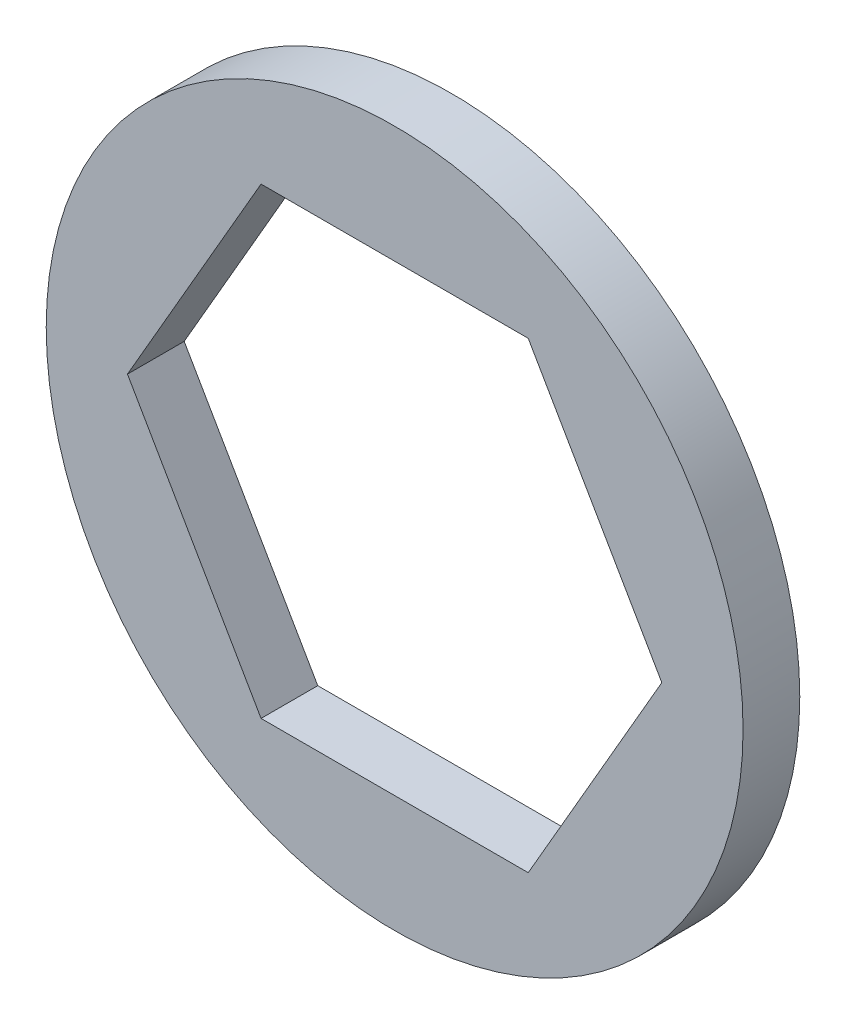
ISO-10303-21;
HEADER;
FILE_DESCRIPTION(('STEP AP214'),'2;1');
FILE_NAME('part.step','',(''),(''),'','','');
FILE_SCHEMA(('AUTOMOTIVE_DESIGN { 1 0 10303 214 1 1 1 1 }'));
ENDSEC;
DATA;
#1=APPLICATION_CONTEXT('core data for automotive mechanical design processes');
#2=APPLICATION_PROTOCOL_DEFINITION('international standard','automotive_design',2000,#1);
#3=PRODUCT_CONTEXT('',#1,'mechanical');
#4=PRODUCT('Part','Part','',(#3));
#5=PRODUCT_RELATED_PRODUCT_CATEGORY('part','',(#4));
#6=PRODUCT_DEFINITION_FORMATION('','',#4);
#7=PRODUCT_DEFINITION_CONTEXT('part definition',#1,'design');
#8=PRODUCT_DEFINITION('design','',#6,#7);
#9=PRODUCT_DEFINITION_SHAPE('','',#8);
#10=(LENGTH_UNIT() NAMED_UNIT(*) SI_UNIT(.MILLI.,.METRE.));
#11=(NAMED_UNIT(*) PLANE_ANGLE_UNIT() SI_UNIT($,.RADIAN.));
#12=(NAMED_UNIT(*) SI_UNIT($,.STERADIAN.) SOLID_ANGLE_UNIT());
#13=UNCERTAINTY_MEASURE_WITH_UNIT(LENGTH_MEASURE(1.E-05),#10,'distance_accuracy_value','');
#14=(GEOMETRIC_REPRESENTATION_CONTEXT(3) GLOBAL_UNCERTAINTY_ASSIGNED_CONTEXT((#13)) GLOBAL_UNIT_ASSIGNED_CONTEXT((#10,
#11,#12)) REPRESENTATION_CONTEXT('',''));
#15=CARTESIAN_POINT('',(0.,0.,0.));
#16=DIRECTION('',(0.,0.,1.));
#17=DIRECTION('',(1.,0.,0.));
#18=AXIS2_PLACEMENT_3D('',#15,#16,#17);
#19=CARTESIAN_POINT('',(0.,0.,1.5875));
#20=DIRECTION('',(0.,0.,1.));
#21=DIRECTION('',(1.,0.,0.));
#22=AXIS2_PLACEMENT_3D('',#19,#20,#21);
#23=PLANE('',#22);
#24=CARTESIAN_POINT('',(0.,0.,1.5875));
#25=DIRECTION('',(0.,0.,1.));
#26=DIRECTION('',(1.,0.,0.));
#27=AXIS2_PLACEMENT_3D('',#24,#25,#26);
#28=CIRCLE('',#27,9.7536);
#29=CARTESIAN_POINT('',(9.7536,0.,1.5875));
#30=VERTEX_POINT('',#29);
#31=EDGE_CURVE('E11',#30,#30,#28,.T.);
#32=ORIENTED_EDGE('',*,*,#31,.T.);
#33=EDGE_LOOP('',(#32));
#34=FACE_BOUND('',#33,.T.);
#35=DIRECTION('',(-0.5,0.866025403784438,0.));
#36=VECTOR('',#35,1.);
#37=CARTESIAN_POINT('',(7.47899538708242,0.,1.5875));
#38=LINE('',#37,#36);
#39=CARTESIAN_POINT('',(7.47899538708242,0.,1.5875));
#40=VERTEX_POINT('',#39);
#41=CARTESIAN_POINT('',(3.7394976935412,6.47700000000002,1.5875));
#42=VERTEX_POINT('',#41);
#43=EDGE_CURVE('E113',#40,#42,#38,.T.);
#44=ORIENTED_EDGE('',*,*,#43,.F.);
#45=DIRECTION('',(0.5,0.866025403784439,0.));
#46=VECTOR('',#45,1.);
#47=CARTESIAN_POINT('',(3.7394976935412,-6.47700000000001,1.5875));
#48=LINE('',#47,#46);
#49=CARTESIAN_POINT('',(3.7394976935412,-6.47700000000001,1.5875));
#50=VERTEX_POINT('',#49);
#51=EDGE_CURVE('E104',#50,#40,#48,.T.);
#52=ORIENTED_EDGE('',*,*,#51,.F.);
#53=DIRECTION('',(1.,0.,0.));
#54=VECTOR('',#53,1.);
#55=CARTESIAN_POINT('',(-3.73949769354121,-6.47700000000001,1.5875));
#56=LINE('',#55,#54);
#57=CARTESIAN_POINT('',(-3.73949769354121,-6.47700000000001,1.5875));
#58=VERTEX_POINT('',#57);
#59=EDGE_CURVE('E140',#58,#50,#56,.T.);
#60=ORIENTED_EDGE('',*,*,#59,.F.);
#61=DIRECTION('',(0.5,-0.866025403784439,0.));
#62=VECTOR('',#61,1.);
#63=CARTESIAN_POINT('',(-7.47899538708242,0.,1.5875));
#64=LINE('',#63,#62);
#65=CARTESIAN_POINT('',(-7.47899538708242,0.,1.5875));
#66=VERTEX_POINT('',#65);
#67=EDGE_CURVE('E137',#66,#58,#64,.T.);
#68=ORIENTED_EDGE('',*,*,#67,.F.);
#69=DIRECTION('',(-0.5,-0.866025403784439,0.));
#70=VECTOR('',#69,1.);
#71=CARTESIAN_POINT('',(-3.73949769354121,6.47700000000002,1.5875));
#72=LINE('',#71,#70);
#73=CARTESIAN_POINT('',(-3.73949769354121,6.47700000000002,1.5875));
#74=VERTEX_POINT('',#73);
#75=EDGE_CURVE('E132',#74,#66,#72,.T.);
#76=ORIENTED_EDGE('',*,*,#75,.F.);
#77=DIRECTION('',(-1.,0.,0.));
#78=VECTOR('',#77,1.);
#79=CARTESIAN_POINT('',(3.7394976935412,6.47700000000002,1.5875));
#80=LINE('',#79,#78);
#81=EDGE_CURVE('E126',#42,#74,#80,.T.);
#82=ORIENTED_EDGE('',*,*,#81,.F.);
#83=EDGE_LOOP('',(#44,#52,#60,#68,#76,#82));
#84=FACE_BOUND('',#83,.T.);
#85=ADVANCED_FACE('F38',(#34,#84),#23,.T.);
#86=CARTESIAN_POINT('',(0.,0.,0.));
#87=DIRECTION('',(0.,0.,1.));
#88=DIRECTION('',(1.,0.,0.));
#89=AXIS2_PLACEMENT_3D('',#86,#87,#88);
#90=PLANE('',#89);
#91=CARTESIAN_POINT('',(0.,0.,0.));
#92=DIRECTION('',(0.,0.,1.));
#93=DIRECTION('',(1.,0.,0.));
#94=AXIS2_PLACEMENT_3D('',#91,#92,#93);
#95=CIRCLE('',#94,9.7536);
#96=CARTESIAN_POINT('',(9.7536,0.,0.));
#97=VERTEX_POINT('',#96);
#98=EDGE_CURVE('E42',#97,#97,#95,.T.);
#99=ORIENTED_EDGE('',*,*,#98,.F.);
#100=EDGE_LOOP('',(#99));
#101=FACE_BOUND('',#100,.T.);
#102=DIRECTION('',(0.5,0.866025403784439,0.));
#103=VECTOR('',#102,1.);
#104=CARTESIAN_POINT('',(3.7394976935412,-6.47700000000001,0.));
#105=LINE('',#104,#103);
#106=CARTESIAN_POINT('',(3.7394976935412,-6.47700000000001,0.));
#107=VERTEX_POINT('',#106);
#108=CARTESIAN_POINT('',(7.47899538708242,0.,0.));
#109=VERTEX_POINT('',#108);
#110=EDGE_CURVE('E66',#107,#109,#105,.T.);
#111=ORIENTED_EDGE('',*,*,#110,.T.);
#112=DIRECTION('',(-0.5,0.866025403784438,0.));
#113=VECTOR('',#112,1.);
#114=CARTESIAN_POINT('',(7.47899538708242,0.,0.));
#115=LINE('',#114,#113);
#116=CARTESIAN_POINT('',(3.7394976935412,6.47700000000002,0.));
#117=VERTEX_POINT('',#116);
#118=EDGE_CURVE('E120',#109,#117,#115,.T.);
#119=ORIENTED_EDGE('',*,*,#118,.T.);
#120=DIRECTION('',(-1.,0.,0.));
#121=VECTOR('',#120,1.);
#122=CARTESIAN_POINT('',(3.7394976935412,6.47700000000002,0.));
#123=LINE('',#122,#121);
#124=CARTESIAN_POINT('',(-3.73949769354121,6.47700000000002,0.));
#125=VERTEX_POINT('',#124);
#126=EDGE_CURVE('E146',#117,#125,#123,.T.);
#127=ORIENTED_EDGE('',*,*,#126,.T.);
#128=DIRECTION('',(-0.5,-0.866025403784439,0.));
#129=VECTOR('',#128,1.);
#130=CARTESIAN_POINT('',(-3.73949769354121,6.47700000000002,0.));
#131=LINE('',#130,#129);
#132=CARTESIAN_POINT('',(-7.47899538708242,0.,0.));
#133=VERTEX_POINT('',#132);
#134=EDGE_CURVE('E150',#125,#133,#131,.T.);
#135=ORIENTED_EDGE('',*,*,#134,.T.);
#136=DIRECTION('',(0.5,-0.866025403784439,0.));
#137=VECTOR('',#136,1.);
#138=CARTESIAN_POINT('',(-7.47899538708242,0.,0.));
#139=LINE('',#138,#137);
#140=CARTESIAN_POINT('',(-3.73949769354121,-6.47700000000001,0.));
#141=VERTEX_POINT('',#140);
#142=EDGE_CURVE('E154',#133,#141,#139,.T.);
#143=ORIENTED_EDGE('',*,*,#142,.T.);
#144=DIRECTION('',(1.,0.,0.));
#145=VECTOR('',#144,1.);
#146=CARTESIAN_POINT('',(-3.73949769354121,-6.47700000000001,0.));
#147=LINE('',#146,#145);
#148=EDGE_CURVE('E114',#141,#107,#147,.T.);
#149=ORIENTED_EDGE('',*,*,#148,.T.);
#150=EDGE_LOOP('',(#111,#119,#127,#135,#143,#149));
#151=FACE_BOUND('',#150,.T.);
#152=ADVANCED_FACE('F177',(#101,#151),#90,.F.);
#153=CARTESIAN_POINT('',(0.,0.,1.5875));
#154=DIRECTION('',(0.,0.,-1.));
#155=DIRECTION('',(-1.,0.,0.));
#156=AXIS2_PLACEMENT_3D('',#153,#154,#155);
#157=CYLINDRICAL_SURFACE('',#156,9.7536);
#158=ORIENTED_EDGE('',*,*,#31,.F.);
#159=EDGE_LOOP('',(#158));
#160=FACE_BOUND('',#159,.T.);
#161=ORIENTED_EDGE('',*,*,#98,.T.);
#162=EDGE_LOOP('',(#161));
#163=FACE_BOUND('',#162,.T.);
#164=ADVANCED_FACE('F40',(#160,#163),#157,.T.);
#165=CARTESIAN_POINT('',(3.7394976935412,-6.47700000000001,1.5875));
#166=DIRECTION('',(-0.866025403784438,0.5,0.));
#167=DIRECTION('',(-0.5,-0.866025403784439,0.));
#168=AXIS2_PLACEMENT_3D('',#165,#166,#167);
#169=PLANE('',#168);
#170=ORIENTED_EDGE('',*,*,#110,.F.);
#171=DIRECTION('',(0.,0.,-1.));
#172=VECTOR('',#171,1.);
#173=CARTESIAN_POINT('',(3.7394976935412,-6.47700000000001,1.5875));
#174=LINE('',#173,#172);
#175=EDGE_CURVE('E108',#50,#107,#174,.T.);
#176=ORIENTED_EDGE('',*,*,#175,.F.);
#177=ORIENTED_EDGE('',*,*,#51,.T.);
#178=DIRECTION('',(0.,0.,-1.));
#179=VECTOR('',#178,1.);
#180=CARTESIAN_POINT('',(7.47899538708242,0.,1.5875));
#181=LINE('',#180,#179);
#182=EDGE_CURVE('E107',#40,#109,#181,.T.);
#183=ORIENTED_EDGE('',*,*,#182,.T.);
#184=EDGE_LOOP('',(#170,#176,#177,#183));
#185=FACE_BOUND('',#184,.T.);
#186=ADVANCED_FACE('F106',(#185),#169,.T.);
#187=CARTESIAN_POINT('',(7.47899538708242,0.,1.5875));
#188=DIRECTION('',(-0.866025403784438,-0.5,0.));
#189=DIRECTION('',(0.5,-0.866025403784438,0.));
#190=AXIS2_PLACEMENT_3D('',#187,#188,#189);
#191=PLANE('',#190);
#192=ORIENTED_EDGE('',*,*,#118,.F.);
#193=ORIENTED_EDGE('',*,*,#182,.F.);
#194=ORIENTED_EDGE('',*,*,#43,.T.);
#195=DIRECTION('',(0.,0.,-1.));
#196=VECTOR('',#195,1.);
#197=CARTESIAN_POINT('',(3.7394976935412,6.47700000000002,1.5875));
#198=LINE('',#197,#196);
#199=EDGE_CURVE('E122',#42,#117,#198,.T.);
#200=ORIENTED_EDGE('',*,*,#199,.T.);
#201=EDGE_LOOP('',(#192,#193,#194,#200));
#202=FACE_BOUND('',#201,.T.);
#203=ADVANCED_FACE('F117',(#202),#191,.T.);
#204=CARTESIAN_POINT('',(3.7394976935412,6.47700000000002,1.5875));
#205=DIRECTION('',(0.,-1.,0.));
#206=DIRECTION('',(0.,0.,-1.));
#207=AXIS2_PLACEMENT_3D('',#204,#205,#206);
#208=PLANE('',#207);
#209=ORIENTED_EDGE('',*,*,#126,.F.);
#210=ORIENTED_EDGE('',*,*,#199,.F.);
#211=ORIENTED_EDGE('',*,*,#81,.T.);
#212=DIRECTION('',(0.,0.,-1.));
#213=VECTOR('',#212,1.);
#214=CARTESIAN_POINT('',(-3.73949769354121,6.47700000000002,1.5875));
#215=LINE('',#214,#213);
#216=EDGE_CURVE('E168',#74,#125,#215,.T.);
#217=ORIENTED_EDGE('',*,*,#216,.T.);
#218=EDGE_LOOP('',(#209,#210,#211,#217));
#219=FACE_BOUND('',#218,.T.);
#220=ADVANCED_FACE('F173',(#219),#208,.T.);
#221=CARTESIAN_POINT('',(-3.73949769354121,6.47700000000002,1.5875));
#222=DIRECTION('',(0.866025403784439,-0.5,0.));
#223=DIRECTION('',(0.5,0.866025403784439,0.));
#224=AXIS2_PLACEMENT_3D('',#221,#222,#223);
#225=PLANE('',#224);
#226=ORIENTED_EDGE('',*,*,#134,.F.);
#227=ORIENTED_EDGE('',*,*,#216,.F.);
#228=ORIENTED_EDGE('',*,*,#75,.T.);
#229=DIRECTION('',(0.,0.,-1.));
#230=VECTOR('',#229,1.);
#231=CARTESIAN_POINT('',(-7.47899538708242,0.,1.5875));
#232=LINE('',#231,#230);
#233=EDGE_CURVE('E165',#66,#133,#232,.T.);
#234=ORIENTED_EDGE('',*,*,#233,.T.);
#235=EDGE_LOOP('',(#226,#227,#228,#234));
#236=FACE_BOUND('',#235,.T.);
#237=ADVANCED_FACE('F185',(#236),#225,.T.);
#238=CARTESIAN_POINT('',(-7.47899538708242,0.,1.5875));
#239=DIRECTION('',(0.866025403784439,0.5,0.));
#240=DIRECTION('',(-0.5,0.866025403784439,0.));
#241=AXIS2_PLACEMENT_3D('',#238,#239,#240);
#242=PLANE('',#241);
#243=ORIENTED_EDGE('',*,*,#142,.F.);
#244=ORIENTED_EDGE('',*,*,#233,.F.);
#245=ORIENTED_EDGE('',*,*,#67,.T.);
#246=DIRECTION('',(0.,0.,-1.));
#247=VECTOR('',#246,1.);
#248=CARTESIAN_POINT('',(-3.73949769354121,-6.47700000000001,1.5875));
#249=LINE('',#248,#247);
#250=EDGE_CURVE('E57',#58,#141,#249,.T.);
#251=ORIENTED_EDGE('',*,*,#250,.T.);
#252=EDGE_LOOP('',(#243,#244,#245,#251));
#253=FACE_BOUND('',#252,.T.);
#254=ADVANCED_FACE('F183',(#253),#242,.T.);
#255=CARTESIAN_POINT('',(-3.73949769354121,-6.47700000000001,1.5875));
#256=DIRECTION('',(0.,1.,0.));
#257=DIRECTION('',(0.,0.,1.));
#258=AXIS2_PLACEMENT_3D('',#255,#256,#257);
#259=PLANE('',#258);
#260=ORIENTED_EDGE('',*,*,#148,.F.);
#261=ORIENTED_EDGE('',*,*,#250,.F.);
#262=ORIENTED_EDGE('',*,*,#59,.T.);
#263=ORIENTED_EDGE('',*,*,#175,.T.);
#264=EDGE_LOOP('',(#260,#261,#262,#263));
#265=FACE_BOUND('',#264,.T.);
#266=ADVANCED_FACE('F179',(#265),#259,.T.);
#267=CLOSED_SHELL('',(#85,#152,#164,#186,#203,#220,#237,#254,#266));
#268=MANIFOLD_SOLID_BREP('B2',#267);
#269=ADVANCED_BREP_SHAPE_REPRESENTATION('',(#18,#268),#14);
#270=SHAPE_DEFINITION_REPRESENTATION(#9,#269);
ENDSEC;
END-ISO-10303-21;
